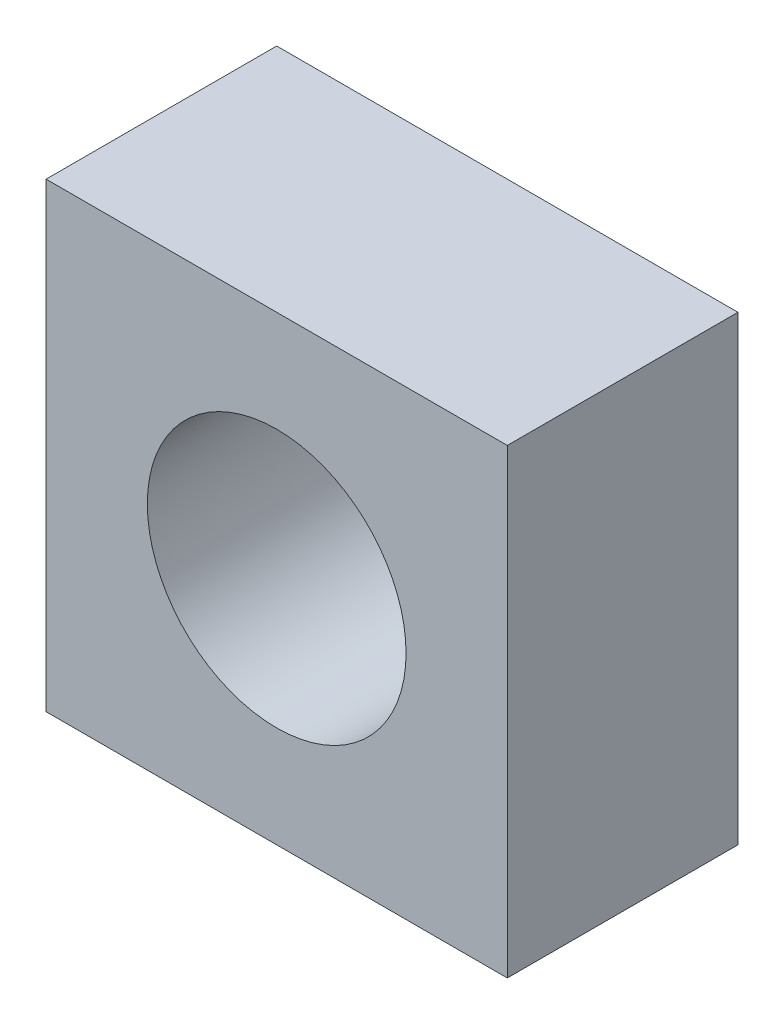
ISO-10303-21;
HEADER;
FILE_DESCRIPTION(('STEP AP214'),'2;1');
FILE_NAME('part.step','',(''),(''),'','','');
FILE_SCHEMA(('AUTOMOTIVE_DESIGN { 1 0 10303 214 1 1 1 1 }'));
ENDSEC;
DATA;
#1=APPLICATION_CONTEXT('core data for automotive mechanical design processes');
#2=APPLICATION_PROTOCOL_DEFINITION('international standard','automotive_design',2000,#1);
#3=PRODUCT_CONTEXT('',#1,'mechanical');
#4=PRODUCT('Part','Part','',(#3));
#5=PRODUCT_RELATED_PRODUCT_CATEGORY('part','',(#4));
#6=PRODUCT_DEFINITION_FORMATION('','',#4);
#7=PRODUCT_DEFINITION_CONTEXT('part definition',#1,'design');
#8=PRODUCT_DEFINITION('design','',#6,#7);
#9=PRODUCT_DEFINITION_SHAPE('','',#8);
#10=(LENGTH_UNIT() NAMED_UNIT(*) SI_UNIT(.MILLI.,.METRE.));
#11=(NAMED_UNIT(*) PLANE_ANGLE_UNIT() SI_UNIT($,.RADIAN.));
#12=(NAMED_UNIT(*) SI_UNIT($,.STERADIAN.) SOLID_ANGLE_UNIT());
#13=UNCERTAINTY_MEASURE_WITH_UNIT(LENGTH_MEASURE(1.E-05),#10,'distance_accuracy_value','');
#14=(GEOMETRIC_REPRESENTATION_CONTEXT(3) GLOBAL_UNCERTAINTY_ASSIGNED_CONTEXT((#13)) GLOBAL_UNIT_ASSIGNED_CONTEXT((#10,
#11,#12)) REPRESENTATION_CONTEXT('',''));
#15=CARTESIAN_POINT('',(0.,0.,0.));
#16=DIRECTION('',(0.,0.,1.));
#17=DIRECTION('',(1.,0.,0.));
#18=AXIS2_PLACEMENT_3D('',#15,#16,#17);
#19=CARTESIAN_POINT('',(0.,0.,20.));
#20=DIRECTION('',(0.,0.,-1.));
#21=DIRECTION('',(-1.,0.,0.));
#22=AXIS2_PLACEMENT_3D('',#19,#20,#21);
#23=PLANE('',#22);
#24=DIRECTION('',(0.,1.,0.));
#25=VECTOR('',#24,1.);
#26=CARTESIAN_POINT('',(20.,-20.,20.));
#27=LINE('',#26,#25);
#28=CARTESIAN_POINT('',(20.,-20.,20.));
#29=VERTEX_POINT('',#28);
#30=CARTESIAN_POINT('',(20.,20.,20.));
#31=VERTEX_POINT('',#30);
#32=EDGE_CURVE('E87',#29,#31,#27,.T.);
#33=ORIENTED_EDGE('',*,*,#32,.T.);
#34=DIRECTION('',(-1.,0.,0.));
#35=VECTOR('',#34,1.);
#36=CARTESIAN_POINT('',(-20.,20.,20.));
#37=LINE('',#36,#35);
#38=CARTESIAN_POINT('',(-20.,20.,20.));
#39=VERTEX_POINT('',#38);
#40=EDGE_CURVE('E82',#31,#39,#37,.T.);
#41=ORIENTED_EDGE('',*,*,#40,.T.);
#42=DIRECTION('',(0.,-1.,0.));
#43=VECTOR('',#42,1.);
#44=CARTESIAN_POINT('',(-20.,-20.,20.));
#45=LINE('',#44,#43);
#46=CARTESIAN_POINT('',(-20.,-20.,20.));
#47=VERTEX_POINT('',#46);
#48=EDGE_CURVE('E85',#39,#47,#45,.T.);
#49=ORIENTED_EDGE('',*,*,#48,.T.);
#50=DIRECTION('',(1.,0.,0.));
#51=VECTOR('',#50,1.);
#52=CARTESIAN_POINT('',(-20.,-20.,20.));
#53=LINE('',#52,#51);
#54=EDGE_CURVE('E52',#47,#29,#53,.T.);
#55=ORIENTED_EDGE('',*,*,#54,.T.);
#56=EDGE_LOOP('',(#33,#41,#49,#55));
#57=FACE_BOUND('',#56,.T.);
#58=CARTESIAN_POINT('',(0.,0.,20.));
#59=DIRECTION('',(0.,0.,1.));
#60=DIRECTION('',(1.,0.,0.));
#61=AXIS2_PLACEMENT_3D('',#58,#59,#60);
#62=CIRCLE('',#61,11.2192326146508);
#63=CARTESIAN_POINT('',(11.2192326146508,0.,20.));
#64=VERTEX_POINT('',#63);
#65=EDGE_CURVE('E102',#64,#64,#62,.T.);
#66=ORIENTED_EDGE('',*,*,#65,.F.);
#67=EDGE_LOOP('',(#66));
#68=FACE_BOUND('',#67,.T.);
#69=ADVANCED_FACE('F35',(#57,#68),#23,.F.);
#70=CARTESIAN_POINT('',(0.,0.,0.));
#71=DIRECTION('',(0.,0.,-1.));
#72=DIRECTION('',(-1.,0.,0.));
#73=AXIS2_PLACEMENT_3D('',#70,#71,#72);
#74=PLANE('',#73);
#75=DIRECTION('',(0.,1.,0.));
#76=VECTOR('',#75,1.);
#77=CARTESIAN_POINT('',(20.,-20.,0.));
#78=LINE('',#77,#76);
#79=CARTESIAN_POINT('',(20.,-20.,0.));
#80=VERTEX_POINT('',#79);
#81=CARTESIAN_POINT('',(20.,20.,0.));
#82=VERTEX_POINT('',#81);
#83=EDGE_CURVE('E99',#80,#82,#78,.T.);
#84=ORIENTED_EDGE('',*,*,#83,.F.);
#85=DIRECTION('',(1.,0.,0.));
#86=VECTOR('',#85,1.);
#87=CARTESIAN_POINT('',(-20.,-20.,0.));
#88=LINE('',#87,#86);
#89=CARTESIAN_POINT('',(-20.,-20.,0.));
#90=VERTEX_POINT('',#89);
#91=EDGE_CURVE('E75',#90,#80,#88,.T.);
#92=ORIENTED_EDGE('',*,*,#91,.F.);
#93=DIRECTION('',(0.,-1.,0.));
#94=VECTOR('',#93,1.);
#95=CARTESIAN_POINT('',(-20.,-20.,0.));
#96=LINE('',#95,#94);
#97=CARTESIAN_POINT('',(-20.,20.,0.));
#98=VERTEX_POINT('',#97);
#99=EDGE_CURVE('E69',#98,#90,#96,.T.);
#100=ORIENTED_EDGE('',*,*,#99,.F.);
#101=DIRECTION('',(-1.,0.,0.));
#102=VECTOR('',#101,1.);
#103=CARTESIAN_POINT('',(-20.,20.,0.));
#104=LINE('',#103,#102);
#105=EDGE_CURVE('E91',#82,#98,#104,.T.);
#106=ORIENTED_EDGE('',*,*,#105,.F.);
#107=EDGE_LOOP('',(#84,#92,#100,#106));
#108=FACE_BOUND('',#107,.T.);
#109=CARTESIAN_POINT('',(0.,0.,0.));
#110=DIRECTION('',(0.,0.,1.));
#111=DIRECTION('',(1.,0.,0.));
#112=AXIS2_PLACEMENT_3D('',#109,#110,#111);
#113=CIRCLE('',#112,11.2192326146508);
#114=CARTESIAN_POINT('',(11.2192326146508,0.,0.));
#115=VERTEX_POINT('',#114);
#116=EDGE_CURVE('E114',#115,#115,#113,.T.);
#117=ORIENTED_EDGE('',*,*,#116,.T.);
#118=EDGE_LOOP('',(#117));
#119=FACE_BOUND('',#118,.T.);
#120=ADVANCED_FACE('F110',(#108,#119),#74,.T.);
#121=CARTESIAN_POINT('',(20.,-20.,20.));
#122=DIRECTION('',(-1.,0.,0.));
#123=DIRECTION('',(0.,0.,1.));
#124=AXIS2_PLACEMENT_3D('',#121,#122,#123);
#125=PLANE('',#124);
#126=ORIENTED_EDGE('',*,*,#83,.T.);
#127=DIRECTION('',(0.,0.,-1.));
#128=VECTOR('',#127,1.);
#129=CARTESIAN_POINT('',(20.,20.,20.));
#130=LINE('',#129,#128);
#131=EDGE_CURVE('E11',#31,#82,#130,.T.);
#132=ORIENTED_EDGE('',*,*,#131,.F.);
#133=ORIENTED_EDGE('',*,*,#32,.F.);
#134=DIRECTION('',(0.,0.,-1.));
#135=VECTOR('',#134,1.);
#136=CARTESIAN_POINT('',(20.,-20.,20.));
#137=LINE('',#136,#135);
#138=EDGE_CURVE('E95',#29,#80,#137,.T.);
#139=ORIENTED_EDGE('',*,*,#138,.T.);
#140=EDGE_LOOP('',(#126,#132,#133,#139));
#141=FACE_BOUND('',#140,.T.);
#142=ADVANCED_FACE('F37',(#141),#125,.F.);
#143=CARTESIAN_POINT('',(-20.,20.,20.));
#144=DIRECTION('',(0.,-1.,0.));
#145=DIRECTION('',(0.,0.,-1.));
#146=AXIS2_PLACEMENT_3D('',#143,#144,#145);
#147=PLANE('',#146);
#148=ORIENTED_EDGE('',*,*,#105,.T.);
#149=DIRECTION('',(0.,0.,-1.));
#150=VECTOR('',#149,1.);
#151=CARTESIAN_POINT('',(-20.,20.,20.));
#152=LINE('',#151,#150);
#153=EDGE_CURVE('E44',#39,#98,#152,.T.);
#154=ORIENTED_EDGE('',*,*,#153,.F.);
#155=ORIENTED_EDGE('',*,*,#40,.F.);
#156=ORIENTED_EDGE('',*,*,#131,.T.);
#157=EDGE_LOOP('',(#148,#154,#155,#156));
#158=FACE_BOUND('',#157,.T.);
#159=ADVANCED_FACE('F90',(#158),#147,.F.);
#160=CARTESIAN_POINT('',(-20.,-20.,20.));
#161=DIRECTION('',(1.,0.,0.));
#162=DIRECTION('',(0.,0.,-1.));
#163=AXIS2_PLACEMENT_3D('',#160,#161,#162);
#164=PLANE('',#163);
#165=ORIENTED_EDGE('',*,*,#99,.T.);
#166=DIRECTION('',(0.,0.,-1.));
#167=VECTOR('',#166,1.);
#168=CARTESIAN_POINT('',(-20.,-20.,20.));
#169=LINE('',#168,#167);
#170=EDGE_CURVE('E92',#47,#90,#169,.T.);
#171=ORIENTED_EDGE('',*,*,#170,.F.);
#172=ORIENTED_EDGE('',*,*,#48,.F.);
#173=ORIENTED_EDGE('',*,*,#153,.T.);
#174=EDGE_LOOP('',(#165,#171,#172,#173));
#175=FACE_BOUND('',#174,.T.);
#176=ADVANCED_FACE('F93',(#175),#164,.F.);
#177=CARTESIAN_POINT('',(-20.,-20.,20.));
#178=DIRECTION('',(0.,1.,0.));
#179=DIRECTION('',(0.,0.,1.));
#180=AXIS2_PLACEMENT_3D('',#177,#178,#179);
#181=PLANE('',#180);
#182=ORIENTED_EDGE('',*,*,#91,.T.);
#183=ORIENTED_EDGE('',*,*,#138,.F.);
#184=ORIENTED_EDGE('',*,*,#54,.F.);
#185=ORIENTED_EDGE('',*,*,#170,.T.);
#186=EDGE_LOOP('',(#182,#183,#184,#185));
#187=FACE_BOUND('',#186,.T.);
#188=ADVANCED_FACE('F107',(#187),#181,.F.);
#189=CARTESIAN_POINT('',(0.,0.,20.));
#190=DIRECTION('',(0.,0.,-1.));
#191=DIRECTION('',(-1.,0.,0.));
#192=AXIS2_PLACEMENT_3D('',#189,#190,#191);
#193=CYLINDRICAL_SURFACE('',#192,11.2192326146508);
#194=ORIENTED_EDGE('',*,*,#65,.T.);
#195=EDGE_LOOP('',(#194));
#196=FACE_BOUND('',#195,.T.);
#197=ORIENTED_EDGE('',*,*,#116,.F.);
#198=EDGE_LOOP('',(#197));
#199=FACE_BOUND('',#198,.T.);
#200=ADVANCED_FACE('F120',(#196,#199),#193,.F.);
#201=CLOSED_SHELL('',(#69,#120,#142,#159,#176,#188,#200));
#202=MANIFOLD_SOLID_BREP('B2',#201);
#203=ADVANCED_BREP_SHAPE_REPRESENTATION('',(#18,#202),#14);
#204=SHAPE_DEFINITION_REPRESENTATION(#9,#203);
ENDSEC;
END-ISO-10303-21;
